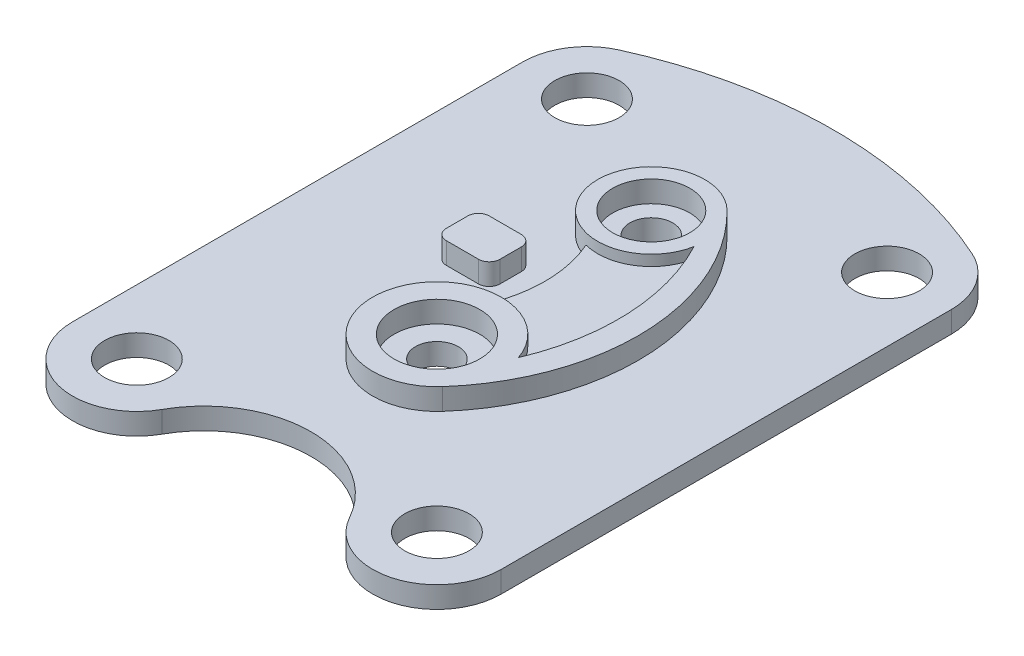
ISO-10303-21;
HEADER;
FILE_DESCRIPTION(('STEP AP214'),'2;1');
FILE_NAME('part.step','',(''),(''),'','','');
FILE_SCHEMA(('AUTOMOTIVE_DESIGN { 1 0 10303 214 1 1 1 1 }'));
ENDSEC;
DATA;
#1=APPLICATION_CONTEXT('core data for automotive mechanical design processes');
#2=APPLICATION_PROTOCOL_DEFINITION('international standard','automotive_design',2000,#1);
#3=PRODUCT_CONTEXT('',#1,'mechanical');
#4=PRODUCT('Part','Part','',(#3));
#5=PRODUCT_RELATED_PRODUCT_CATEGORY('part','',(#4));
#6=PRODUCT_DEFINITION_FORMATION('','',#4);
#7=PRODUCT_DEFINITION_CONTEXT('part definition',#1,'design');
#8=PRODUCT_DEFINITION('design','',#6,#7);
#9=PRODUCT_DEFINITION_SHAPE('','',#8);
#10=(LENGTH_UNIT() NAMED_UNIT(*) SI_UNIT(.MILLI.,.METRE.));
#11=(NAMED_UNIT(*) PLANE_ANGLE_UNIT() SI_UNIT($,.RADIAN.));
#12=(NAMED_UNIT(*) SI_UNIT($,.STERADIAN.) SOLID_ANGLE_UNIT());
#13=UNCERTAINTY_MEASURE_WITH_UNIT(LENGTH_MEASURE(1.E-05),#10,'distance_accuracy_value','');
#14=(GEOMETRIC_REPRESENTATION_CONTEXT(3) GLOBAL_UNCERTAINTY_ASSIGNED_CONTEXT((#13)) GLOBAL_UNIT_ASSIGNED_CONTEXT((#10,
#11,#12)) REPRESENTATION_CONTEXT('',''));
#15=CARTESIAN_POINT('',(0.,0.,0.));
#16=DIRECTION('',(0.,0.,1.));
#17=DIRECTION('',(1.,0.,0.));
#18=AXIS2_PLACEMENT_3D('',#15,#16,#17);
#19=CARTESIAN_POINT('',(0.,10.,0.));
#20=DIRECTION('',(0.,1.,0.));
#21=DIRECTION('',(0.,0.,1.));
#22=AXIS2_PLACEMENT_3D('',#19,#20,#21);
#23=PLANE('',#22);
#24=CARTESIAN_POINT('',(-35.5892365848079,10.,-20.));
#25=DIRECTION('',(0.,1.,0.));
#26=DIRECTION('',(0.,0.,1.));
#27=AXIS2_PLACEMENT_3D('',#24,#25,#26);
#28=CIRCLE('',#27,5.);
#29=CARTESIAN_POINT('',(-35.5892365848078,10.,-25.));
#30=VERTEX_POINT('',#29);
#31=CARTESIAN_POINT('',(-40.5892365848079,10.,-20.));
#32=VERTEX_POINT('',#31);
#33=EDGE_CURVE('E398',#30,#32,#28,.T.);
#34=ORIENTED_EDGE('',*,*,#33,.F.);
#35=DIRECTION('',(-1.,0.,0.));
#36=VECTOR('',#35,1.);
#37=CARTESIAN_POINT('',(0.,10.,-25.));
#38=LINE('',#37,#36);
#39=CARTESIAN_POINT('',(-20.5892365848079,10.,-25.));
#40=VERTEX_POINT('',#39);
#41=EDGE_CURVE('E373',#40,#30,#38,.T.);
#42=ORIENTED_EDGE('',*,*,#41,.F.);
#43=CARTESIAN_POINT('',(-20.5892365848079,10.,-20.));
#44=DIRECTION('',(0.,1.,0.));
#45=DIRECTION('',(0.,0.,1.));
#46=AXIS2_PLACEMENT_3D('',#43,#44,#45);
#47=CIRCLE('',#46,5.);
#48=CARTESIAN_POINT('',(-15.5892365848079,10.,-20.));
#49=VERTEX_POINT('',#48);
#50=EDGE_CURVE('E377',#49,#40,#47,.T.);
#51=ORIENTED_EDGE('',*,*,#50,.F.);
#52=DIRECTION('',(0.,0.,1.));
#53=VECTOR('',#52,1.);
#54=CARTESIAN_POINT('',(-15.5892365848079,10.,0.));
#55=LINE('',#54,#53);
#56=CARTESIAN_POINT('',(-15.5892365848079,10.,-10.));
#57=VERTEX_POINT('',#56);
#58=EDGE_CURVE('E381',#49,#57,#55,.T.);
#59=ORIENTED_EDGE('',*,*,#58,.T.);
#60=CARTESIAN_POINT('',(-20.5892365848079,10.,-10.));
#61=DIRECTION('',(0.,1.,0.));
#62=DIRECTION('',(0.,0.,1.));
#63=AXIS2_PLACEMENT_3D('',#60,#61,#62);
#64=CIRCLE('',#63,5.);
#65=CARTESIAN_POINT('',(-20.5892365848079,10.,-5.00000000000002));
#66=VERTEX_POINT('',#65);
#67=EDGE_CURVE('E384',#57,#66,#64,.F.);
#68=ORIENTED_EDGE('',*,*,#67,.T.);
#69=DIRECTION('',(-1.,0.,0.));
#70=VECTOR('',#69,1.);
#71=CARTESIAN_POINT('',(0.,10.,-5.00000000000002));
#72=LINE('',#71,#70);
#73=CARTESIAN_POINT('',(-35.5892365848078,10.,-5.00000000000002));
#74=VERTEX_POINT('',#73);
#75=EDGE_CURVE('E387',#66,#74,#72,.T.);
#76=ORIENTED_EDGE('',*,*,#75,.T.);
#77=CARTESIAN_POINT('',(-35.5892365848079,10.,-10.));
#78=DIRECTION('',(0.,1.,0.));
#79=DIRECTION('',(0.,0.,1.));
#80=AXIS2_PLACEMENT_3D('',#77,#78,#79);
#81=CIRCLE('',#80,5.);
#82=CARTESIAN_POINT('',(-40.5892365848079,10.,-10.));
#83=VERTEX_POINT('',#82);
#84=EDGE_CURVE('E390',#83,#74,#81,.T.);
#85=ORIENTED_EDGE('',*,*,#84,.F.);
#86=DIRECTION('',(0.,0.,1.));
#87=VECTOR('',#86,1.);
#88=CARTESIAN_POINT('',(-40.5892365848079,10.,0.));
#89=LINE('',#88,#87);
#90=EDGE_CURVE('E394',#32,#83,#89,.T.);
#91=ORIENTED_EDGE('',*,*,#90,.F.);
#92=EDGE_LOOP('',(#34,#42,#51,#59,#68,#76,#85,#91));
#93=FACE_BOUND('',#92,.T.);
#94=CARTESIAN_POINT('',(0.,10.,143.729833462074));
#95=DIRECTION('',(0.,1.,0.));
#96=DIRECTION('',(0.,0.,1.));
#97=AXIS2_PLACEMENT_3D('',#94,#95,#96);
#98=CIRCLE('',#97,50.);
#99=CARTESIAN_POINT('',(43.75,10.,119.523687548278));
#100=VERTEX_POINT('',#99);
#101=CARTESIAN_POINT('',(-43.75,10.,119.523687548278));
#102=VERTEX_POINT('',#101);
#103=EDGE_CURVE('E403',#100,#102,#98,.T.);
#104=ORIENTED_EDGE('',*,*,#103,.F.);
#105=CARTESIAN_POINT('',(70.,10.,105.));
#106=DIRECTION('',(0.,1.,0.));
#107=DIRECTION('',(0.,0.,1.));
#108=AXIS2_PLACEMENT_3D('',#105,#106,#107);
#109=CIRCLE('',#108,30.);
#110=CARTESIAN_POINT('',(100.,10.,105.));
#111=VERTEX_POINT('',#110);
#112=EDGE_CURVE('E407',#100,#111,#109,.T.);
#113=ORIENTED_EDGE('',*,*,#112,.T.);
#114=DIRECTION('',(0.,0.,1.));
#115=VECTOR('',#114,1.);
#116=CARTESIAN_POINT('',(100.,10.,0.));
#117=LINE('',#116,#115);
#118=CARTESIAN_POINT('',(100.,10.,-105.));
#119=VERTEX_POINT('',#118);
#120=EDGE_CURVE('E411',#119,#111,#117,.T.);
#121=ORIENTED_EDGE('',*,*,#120,.F.);
#122=CARTESIAN_POINT('',(70.,10.,-105.));
#123=DIRECTION('',(0.,1.,0.));
#124=DIRECTION('',(0.,0.,1.));
#125=AXIS2_PLACEMENT_3D('',#122,#123,#124);
#126=CIRCLE('',#125,30.);
#127=CARTESIAN_POINT('',(82.3529411764706,10.,-132.338705973229));
#128=VERTEX_POINT('',#127);
#129=EDGE_CURVE('E415',#119,#128,#126,.T.);
#130=ORIENTED_EDGE('',*,*,#129,.T.);
#131=CARTESIAN_POINT('',(-1.03060153208433E-13,10.,49.9193338482967));
#132=DIRECTION('',(0.,1.,0.));
#133=DIRECTION('',(0.,0.,1.));
#134=AXIS2_PLACEMENT_3D('',#131,#132,#133);
#135=CIRCLE('',#134,200.);
#136=CARTESIAN_POINT('',(-82.3529411764706,10.,-132.338705973229));
#137=VERTEX_POINT('',#136);
#138=EDGE_CURVE('E418',#128,#137,#135,.T.);
#139=ORIENTED_EDGE('',*,*,#138,.T.);
#140=CARTESIAN_POINT('',(-70.,10.,-105.));
#141=DIRECTION('',(0.,1.,0.));
#142=DIRECTION('',(0.,0.,1.));
#143=AXIS2_PLACEMENT_3D('',#140,#141,#142);
#144=CIRCLE('',#143,30.);
#145=CARTESIAN_POINT('',(-100.,10.,-105.));
#146=VERTEX_POINT('',#145);
#147=EDGE_CURVE('E421',#137,#146,#144,.T.);
#148=ORIENTED_EDGE('',*,*,#147,.T.);
#149=DIRECTION('',(0.,0.,1.));
#150=VECTOR('',#149,1.);
#151=CARTESIAN_POINT('',(-100.,10.,0.));
#152=LINE('',#151,#150);
#153=CARTESIAN_POINT('',(-100.,10.,105.));
#154=VERTEX_POINT('',#153);
#155=EDGE_CURVE('E424',#146,#154,#152,.T.);
#156=ORIENTED_EDGE('',*,*,#155,.T.);
#157=CARTESIAN_POINT('',(-70.,10.,105.));
#158=DIRECTION('',(0.,1.,0.));
#159=DIRECTION('',(0.,0.,1.));
#160=AXIS2_PLACEMENT_3D('',#157,#158,#159);
#161=CIRCLE('',#160,30.);
#162=EDGE_CURVE('E427',#154,#102,#161,.T.);
#163=ORIENTED_EDGE('',*,*,#162,.T.);
#164=EDGE_LOOP('',(#104,#113,#121,#130,#139,#148,#156,#163));
#165=FACE_BOUND('',#164,.T.);
#166=CARTESIAN_POINT('',(70.,10.,105.));
#167=DIRECTION('',(0.,1.,0.));
#168=DIRECTION('',(0.,0.,1.));
#169=AXIS2_PLACEMENT_3D('',#166,#167,#168);
#170=CIRCLE('',#169,15.);
#171=CARTESIAN_POINT('',(70.,10.,120.));
#172=VERTEX_POINT('',#171);
#173=EDGE_CURVE('E430',#172,#172,#170,.T.);
#174=ORIENTED_EDGE('',*,*,#173,.F.);
#175=EDGE_LOOP('',(#174));
#176=FACE_BOUND('',#175,.T.);
#177=CARTESIAN_POINT('',(-70.,10.,-105.));
#178=DIRECTION('',(0.,1.,0.));
#179=DIRECTION('',(0.,0.,1.));
#180=AXIS2_PLACEMENT_3D('',#177,#178,#179);
#181=CIRCLE('',#180,15.);
#182=CARTESIAN_POINT('',(-70.,10.,-90.));
#183=VERTEX_POINT('',#182);
#184=EDGE_CURVE('E434',#183,#183,#181,.T.);
#185=ORIENTED_EDGE('',*,*,#184,.F.);
#186=EDGE_LOOP('',(#185));
#187=FACE_BOUND('',#186,.T.);
#188=CARTESIAN_POINT('',(70.,10.,-105.));
#189=DIRECTION('',(0.,1.,0.));
#190=DIRECTION('',(0.,0.,1.));
#191=AXIS2_PLACEMENT_3D('',#188,#189,#190);
#192=CIRCLE('',#191,15.);
#193=CARTESIAN_POINT('',(70.,10.,-90.));
#194=VERTEX_POINT('',#193);
#195=EDGE_CURVE('E438',#194,#194,#192,.T.);
#196=ORIENTED_EDGE('',*,*,#195,.F.);
#197=EDGE_LOOP('',(#196));
#198=FACE_BOUND('',#197,.T.);
#199=CARTESIAN_POINT('',(-70.,10.,105.));
#200=DIRECTION('',(0.,1.,0.));
#201=DIRECTION('',(0.,0.,1.));
#202=AXIS2_PLACEMENT_3D('',#199,#200,#201);
#203=CIRCLE('',#202,15.);
#204=CARTESIAN_POINT('',(-70.,10.,120.));
#205=VERTEX_POINT('',#204);
#206=EDGE_CURVE('E442',#205,#205,#203,.T.);
#207=ORIENTED_EDGE('',*,*,#206,.F.);
#208=EDGE_LOOP('',(#207));
#209=FACE_BOUND('',#208,.T.);
#210=CARTESIAN_POINT('',(0.,10.,35.));
#211=DIRECTION('',(0.,1.,0.));
#212=DIRECTION('',(0.,0.,1.));
#213=AXIS2_PLACEMENT_3D('',#210,#211,#212);
#214=CIRCLE('',#213,30.);
#215=CARTESIAN_POINT('',(22.471857399868,10.,54.875));
#216=VERTEX_POINT('',#215);
#217=CARTESIAN_POINT('',(-5.35471427427675,10.,5.48175081342294));
#218=VERTEX_POINT('',#217);
#219=EDGE_CURVE('E305',#216,#218,#214,.F.);
#220=ORIENTED_EDGE('',*,*,#219,.T.);
#221=CARTESIAN_POINT('',(-61.1514807670264,10.,-16.58));
#222=DIRECTION('',(0.,1.,0.));
#223=DIRECTION('',(0.,0.,1.));
#224=AXIS2_PLACEMENT_3D('',#221,#222,#223);
#225=CIRCLE('',#224,60.);
#226=CARTESIAN_POINT('',(-6.25496791206931,10.,-40.7951373393902));
#227=VERTEX_POINT('',#226);
#228=EDGE_CURVE('E258',#218,#227,#225,.T.);
#229=ORIENTED_EDGE('',*,*,#228,.T.);
#230=CARTESIAN_POINT('',(0.,10.,-65.));
#231=DIRECTION('',(0.,1.,0.));
#232=DIRECTION('',(0.,0.,1.));
#233=AXIS2_PLACEMENT_3D('',#230,#231,#232);
#234=CIRCLE('',#233,25.);
#235=CARTESIAN_POINT('',(17.4781113110084,10.,-82.875));
#236=VERTEX_POINT('',#235);
#237=EDGE_CURVE('E256',#227,#236,#234,.F.);
#238=ORIENTED_EDGE('',*,*,#237,.T.);
#239=CARTESIAN_POINT('',(-52.4343339330252,10.,-11.375));
#240=DIRECTION('',(0.,1.,0.));
#241=DIRECTION('',(0.,0.,1.));
#242=AXIS2_PLACEMENT_3D('',#239,#240,#241);
#243=CIRCLE('',#242,100.);
#244=EDGE_CURVE('E299',#236,#216,#243,.F.);
#245=ORIENTED_EDGE('',*,*,#244,.T.);
#246=EDGE_LOOP('',(#220,#229,#238,#245));
#247=FACE_BOUND('',#246,.T.);
#248=ADVANCED_FACE('F81',(#93,#165,#176,#187,#198,#209,#247),#23,.T.);
#249=CARTESIAN_POINT('',(0.,20.,-65.));
#250=DIRECTION('',(0.,-1.,0.));
#251=DIRECTION('',(0.,0.,-1.));
#252=AXIS2_PLACEMENT_3D('',#249,#250,#251);
#253=CYLINDRICAL_SURFACE('',#252,25.);
#254=DIRECTION('',(0.,-1.,0.));
#255=VECTOR('',#254,1.);
#256=CARTESIAN_POINT('',(-6.25496791206931,15.,-40.7951373393902));
#257=LINE('',#256,#255);
#258=CARTESIAN_POINT('',(-6.25496791206931,15.,-40.7951373393902));
#259=VERTEX_POINT('',#258);
#260=EDGE_CURVE('E236',#259,#227,#257,.T.);
#261=ORIENTED_EDGE('',*,*,#260,.F.);
#262=CARTESIAN_POINT('',(0.,15.,-65.));
#263=DIRECTION('',(0.,1.,0.));
#264=DIRECTION('',(0.,0.,1.));
#265=AXIS2_PLACEMENT_3D('',#262,#263,#264);
#266=CIRCLE('',#265,25.);
#267=CARTESIAN_POINT('',(24.5652216743476,15.,-60.3578147290136));
#268=VERTEX_POINT('',#267);
#269=EDGE_CURVE('E242',#259,#268,#266,.T.);
#270=ORIENTED_EDGE('',*,*,#269,.T.);
#271=DIRECTION('',(0.,-1.,0.));
#272=VECTOR('',#271,1.);
#273=CARTESIAN_POINT('',(24.5652216743476,20.,-60.3578147290136));
#274=LINE('',#273,#272);
#275=CARTESIAN_POINT('',(24.5652216743476,20.,-60.3578147290136));
#276=VERTEX_POINT('',#275);
#277=EDGE_CURVE('E296',#276,#268,#274,.T.);
#278=ORIENTED_EDGE('',*,*,#277,.F.);
#279=CARTESIAN_POINT('',(0.,20.,-65.));
#280=DIRECTION('',(0.,1.,0.));
#281=DIRECTION('',(0.,0.,1.));
#282=AXIS2_PLACEMENT_3D('',#279,#280,#281);
#283=CIRCLE('',#282,25.);
#284=CARTESIAN_POINT('',(17.4781113110084,20.,-82.875));
#285=VERTEX_POINT('',#284);
#286=EDGE_CURVE('E262',#285,#276,#283,.T.);
#287=ORIENTED_EDGE('',*,*,#286,.F.);
#288=DIRECTION('',(0.,-1.,0.));
#289=VECTOR('',#288,1.);
#290=CARTESIAN_POINT('',(17.4781113110084,20.,-82.875));
#291=LINE('',#290,#289);
#292=EDGE_CURVE('E287',#285,#236,#291,.T.);
#293=ORIENTED_EDGE('',*,*,#292,.T.);
#294=ORIENTED_EDGE('',*,*,#237,.F.);
#295=EDGE_LOOP('',(#261,#270,#278,#287,#293,#294));
#296=FACE_BOUND('',#295,.T.);
#297=ADVANCED_FACE('F254',(#296),#253,.T.);
#298=CARTESIAN_POINT('',(0.,20.,35.));
#299=DIRECTION('',(0.,-1.,0.));
#300=DIRECTION('',(0.,0.,-1.));
#301=AXIS2_PLACEMENT_3D('',#298,#299,#300);
#302=CYLINDRICAL_SURFACE('',#301,30.);
#303=DIRECTION('',(0.,-1.,0.));
#304=VECTOR('',#303,1.);
#305=CARTESIAN_POINT('',(-5.35471427427675,15.,5.48175081342294));
#306=LINE('',#305,#304);
#307=CARTESIAN_POINT('',(-5.35471427427674,15.,5.48175081342292));
#308=VERTEX_POINT('',#307);
#309=EDGE_CURVE('E99',#308,#218,#306,.T.);
#310=ORIENTED_EDGE('',*,*,#309,.T.);
#311=ORIENTED_EDGE('',*,*,#219,.F.);
#312=DIRECTION('',(0.,-1.,0.));
#313=VECTOR('',#312,1.);
#314=CARTESIAN_POINT('',(22.471857399868,20.,54.875));
#315=LINE('',#314,#313);
#316=CARTESIAN_POINT('',(22.471857399868,20.,54.875));
#317=VERTEX_POINT('',#316);
#318=EDGE_CURVE('E107',#317,#216,#315,.T.);
#319=ORIENTED_EDGE('',*,*,#318,.F.);
#320=CARTESIAN_POINT('',(0.,20.,35.));
#321=DIRECTION('',(0.,1.,0.));
#322=DIRECTION('',(0.,0.,1.));
#323=AXIS2_PLACEMENT_3D('',#320,#321,#322);
#324=CIRCLE('',#323,30.);
#325=CARTESIAN_POINT('',(28.4396790634165,20.,25.4509343509498));
#326=VERTEX_POINT('',#325);
#327=EDGE_CURVE('E273',#326,#317,#324,.T.);
#328=ORIENTED_EDGE('',*,*,#327,.F.);
#329=DIRECTION('',(0.,-1.,0.));
#330=VECTOR('',#329,1.);
#331=CARTESIAN_POINT('',(28.4396790634165,20.,25.4509343509498));
#332=LINE('',#331,#330);
#333=CARTESIAN_POINT('',(28.4396790634165,15.,25.4509343509498));
#334=VERTEX_POINT('',#333);
#335=EDGE_CURVE('E292',#326,#334,#332,.T.);
#336=ORIENTED_EDGE('',*,*,#335,.T.);
#337=CARTESIAN_POINT('',(0.,15.,35.));
#338=DIRECTION('',(0.,1.,0.));
#339=DIRECTION('',(0.,0.,1.));
#340=AXIS2_PLACEMENT_3D('',#337,#338,#339);
#341=CIRCLE('',#340,30.);
#342=EDGE_CURVE('E241',#334,#308,#341,.T.);
#343=ORIENTED_EDGE('',*,*,#342,.T.);
#344=EDGE_LOOP('',(#310,#311,#319,#328,#336,#343));
#345=FACE_BOUND('',#344,.T.);
#346=ADVANCED_FACE('F584',(#345),#302,.T.);
#347=CARTESIAN_POINT('',(0.,10.,35.));
#348=DIRECTION('',(0.,1.,0.));
#349=DIRECTION('',(0.,0.,1.));
#350=AXIS2_PLACEMENT_3D('',#347,#348,#349);
#351=CIRCLE('',#350,10.);
#352=CARTESIAN_POINT('',(0.,10.,45.));
#353=VERTEX_POINT('',#352);
#354=EDGE_CURVE('E450',#353,#353,#351,.T.);
#355=ORIENTED_EDGE('',*,*,#354,.F.);
#356=EDGE_LOOP('',(#355));
#357=FACE_BOUND('',#356,.T.);
#358=CARTESIAN_POINT('',(0.,10.,35.));
#359=DIRECTION('',(0.,1.,0.));
#360=DIRECTION('',(0.,0.,1.));
#361=AXIS2_PLACEMENT_3D('',#358,#359,#360);
#362=CIRCLE('',#361,20.);
#363=CARTESIAN_POINT('',(0.,10.,55.));
#364=VERTEX_POINT('',#363);
#365=EDGE_CURVE('E12',#364,#364,#362,.F.);
#366=ORIENTED_EDGE('',*,*,#365,.F.);
#367=EDGE_LOOP('',(#366));
#368=FACE_BOUND('',#367,.T.);
#369=ADVANCED_FACE('F573',(#357,#368),#23,.T.);
#370=CARTESIAN_POINT('',(0.,10.,-65.));
#371=DIRECTION('',(0.,1.,0.));
#372=DIRECTION('',(0.,0.,1.));
#373=AXIS2_PLACEMENT_3D('',#370,#371,#372);
#374=CIRCLE('',#373,10.);
#375=CARTESIAN_POINT('',(0.,10.,-55.));
#376=VERTEX_POINT('',#375);
#377=EDGE_CURVE('E446',#376,#376,#374,.T.);
#378=ORIENTED_EDGE('',*,*,#377,.F.);
#379=EDGE_LOOP('',(#378));
#380=FACE_BOUND('',#379,.T.);
#381=CARTESIAN_POINT('',(0.,10.,-65.));
#382=DIRECTION('',(0.,1.,0.));
#383=DIRECTION('',(0.,0.,1.));
#384=AXIS2_PLACEMENT_3D('',#381,#382,#383);
#385=CIRCLE('',#384,18.);
#386=CARTESIAN_POINT('',(0.,10.,-47.));
#387=VERTEX_POINT('',#386);
#388=EDGE_CURVE('E91',#387,#387,#385,.F.);
#389=ORIENTED_EDGE('',*,*,#388,.F.);
#390=EDGE_LOOP('',(#389));
#391=FACE_BOUND('',#390,.T.);
#392=ADVANCED_FACE('F574',(#380,#391),#23,.T.);
#393=CARTESIAN_POINT('',(0.,10.,143.729833462074));
#394=DIRECTION('',(0.,-1.,0.));
#395=DIRECTION('',(0.,0.,-1.));
#396=AXIS2_PLACEMENT_3D('',#393,#394,#395);
#397=CYLINDRICAL_SURFACE('',#396,50.);
#398=CARTESIAN_POINT('',(0.,0.,143.729833462074));
#399=DIRECTION('',(0.,1.,0.));
#400=DIRECTION('',(0.,0.,1.));
#401=AXIS2_PLACEMENT_3D('',#398,#399,#400);
#402=CIRCLE('',#401,50.);
#403=CARTESIAN_POINT('',(43.75,0.,119.523687548278));
#404=VERTEX_POINT('',#403);
#405=CARTESIAN_POINT('',(-43.75,0.,119.523687548278));
#406=VERTEX_POINT('',#405);
#407=EDGE_CURVE('E402',#404,#406,#402,.T.);
#408=ORIENTED_EDGE('',*,*,#407,.F.);
#409=DIRECTION('',(0.,-1.,0.));
#410=VECTOR('',#409,1.);
#411=CARTESIAN_POINT('',(43.75,10.,119.523687548278));
#412=LINE('',#411,#410);
#413=EDGE_CURVE('E85',#100,#404,#412,.T.);
#414=ORIENTED_EDGE('',*,*,#413,.F.);
#415=ORIENTED_EDGE('',*,*,#103,.T.);
#416=DIRECTION('',(0.,-1.,0.));
#417=VECTOR('',#416,1.);
#418=CARTESIAN_POINT('',(-43.75,10.,119.523687548278));
#419=LINE('',#418,#417);
#420=EDGE_CURVE('E454',#102,#406,#419,.T.);
#421=ORIENTED_EDGE('',*,*,#420,.T.);
#422=EDGE_LOOP('',(#408,#414,#415,#421));
#423=FACE_BOUND('',#422,.T.);
#424=ADVANCED_FACE('F83',(#423),#397,.F.);
#425=CARTESIAN_POINT('',(70.,10.,105.));
#426=DIRECTION('',(0.,-1.,0.));
#427=DIRECTION('',(0.,0.,-1.));
#428=AXIS2_PLACEMENT_3D('',#425,#426,#427);
#429=CYLINDRICAL_SURFACE('',#428,30.);
#430=CARTESIAN_POINT('',(70.,0.,105.));
#431=DIRECTION('',(0.,1.,0.));
#432=DIRECTION('',(0.,0.,1.));
#433=AXIS2_PLACEMENT_3D('',#430,#431,#432);
#434=CIRCLE('',#433,30.);
#435=CARTESIAN_POINT('',(100.,0.,105.));
#436=VERTEX_POINT('',#435);
#437=EDGE_CURVE('E458',#404,#436,#434,.T.);
#438=ORIENTED_EDGE('',*,*,#437,.T.);
#439=DIRECTION('',(0.,-1.,0.));
#440=VECTOR('',#439,1.);
#441=CARTESIAN_POINT('',(100.,10.,105.));
#442=LINE('',#441,#440);
#443=EDGE_CURVE('E525',#111,#436,#442,.T.);
#444=ORIENTED_EDGE('',*,*,#443,.F.);
#445=ORIENTED_EDGE('',*,*,#112,.F.);
#446=ORIENTED_EDGE('',*,*,#413,.T.);
#447=EDGE_LOOP('',(#438,#444,#445,#446));
#448=FACE_BOUND('',#447,.T.);
#449=ADVANCED_FACE('F534',(#448),#429,.T.);
#450=CARTESIAN_POINT('',(100.,10.,0.));
#451=DIRECTION('',(1.,0.,0.));
#452=DIRECTION('',(0.,0.,-1.));
#453=AXIS2_PLACEMENT_3D('',#450,#451,#452);
#454=PLANE('',#453);
#455=DIRECTION('',(0.,0.,1.));
#456=VECTOR('',#455,1.);
#457=CARTESIAN_POINT('',(100.,0.,0.));
#458=LINE('',#457,#456);
#459=CARTESIAN_POINT('',(100.,0.,-105.));
#460=VERTEX_POINT('',#459);
#461=EDGE_CURVE('E462',#460,#436,#458,.T.);
#462=ORIENTED_EDGE('',*,*,#461,.F.);
#463=DIRECTION('',(0.,-1.,0.));
#464=VECTOR('',#463,1.);
#465=CARTESIAN_POINT('',(100.,10.,-105.));
#466=LINE('',#465,#464);
#467=EDGE_CURVE('E523',#119,#460,#466,.T.);
#468=ORIENTED_EDGE('',*,*,#467,.F.);
#469=ORIENTED_EDGE('',*,*,#120,.T.);
#470=ORIENTED_EDGE('',*,*,#443,.T.);
#471=EDGE_LOOP('',(#462,#468,#469,#470));
#472=FACE_BOUND('',#471,.T.);
#473=ADVANCED_FACE('F564',(#472),#454,.T.);
#474=CARTESIAN_POINT('',(70.,10.,-105.));
#475=DIRECTION('',(0.,-1.,0.));
#476=DIRECTION('',(0.,0.,-1.));
#477=AXIS2_PLACEMENT_3D('',#474,#475,#476);
#478=CYLINDRICAL_SURFACE('',#477,30.);
#479=CARTESIAN_POINT('',(70.,0.,-105.));
#480=DIRECTION('',(0.,1.,0.));
#481=DIRECTION('',(0.,0.,1.));
#482=AXIS2_PLACEMENT_3D('',#479,#480,#481);
#483=CIRCLE('',#482,30.);
#484=CARTESIAN_POINT('',(82.3529411764706,0.,-132.338705973229));
#485=VERTEX_POINT('',#484);
#486=EDGE_CURVE('E466',#460,#485,#483,.T.);
#487=ORIENTED_EDGE('',*,*,#486,.T.);
#488=DIRECTION('',(0.,-1.,0.));
#489=VECTOR('',#488,1.);
#490=CARTESIAN_POINT('',(82.3529411764706,10.,-132.338705973229));
#491=LINE('',#490,#489);
#492=EDGE_CURVE('E519',#128,#485,#491,.T.);
#493=ORIENTED_EDGE('',*,*,#492,.F.);
#494=ORIENTED_EDGE('',*,*,#129,.F.);
#495=ORIENTED_EDGE('',*,*,#467,.T.);
#496=EDGE_LOOP('',(#487,#493,#494,#495));
#497=FACE_BOUND('',#496,.T.);
#498=ADVANCED_FACE('F567',(#497),#478,.T.);
#499=CARTESIAN_POINT('',(-1.03060153208433E-13,10.,49.9193338482967));
#500=DIRECTION('',(0.,-1.,0.));
#501=DIRECTION('',(0.,0.,-1.));
#502=AXIS2_PLACEMENT_3D('',#499,#500,#501);
#503=CYLINDRICAL_SURFACE('',#502,200.);
#504=CARTESIAN_POINT('',(-1.03060153208433E-13,0.,49.9193338482967));
#505=DIRECTION('',(0.,1.,0.));
#506=DIRECTION('',(0.,0.,1.));
#507=AXIS2_PLACEMENT_3D('',#504,#505,#506);
#508=CIRCLE('',#507,200.);
#509=CARTESIAN_POINT('',(-82.3529411764706,0.,-132.338705973229));
#510=VERTEX_POINT('',#509);
#511=EDGE_CURVE('E469',#485,#510,#508,.T.);
#512=ORIENTED_EDGE('',*,*,#511,.T.);
#513=DIRECTION('',(0.,-1.,0.));
#514=VECTOR('',#513,1.);
#515=CARTESIAN_POINT('',(-82.3529411764706,10.,-132.338705973229));
#516=LINE('',#515,#514);
#517=EDGE_CURVE('E515',#137,#510,#516,.T.);
#518=ORIENTED_EDGE('',*,*,#517,.F.);
#519=ORIENTED_EDGE('',*,*,#138,.F.);
#520=ORIENTED_EDGE('',*,*,#492,.T.);
#521=EDGE_LOOP('',(#512,#518,#519,#520));
#522=FACE_BOUND('',#521,.T.);
#523=ADVANCED_FACE('F561',(#522),#503,.T.);
#524=CARTESIAN_POINT('',(-70.,10.,-105.));
#525=DIRECTION('',(0.,-1.,0.));
#526=DIRECTION('',(0.,0.,-1.));
#527=AXIS2_PLACEMENT_3D('',#524,#525,#526);
#528=CYLINDRICAL_SURFACE('',#527,30.);
#529=CARTESIAN_POINT('',(-70.,0.,-105.));
#530=DIRECTION('',(0.,1.,0.));
#531=DIRECTION('',(0.,0.,1.));
#532=AXIS2_PLACEMENT_3D('',#529,#530,#531);
#533=CIRCLE('',#532,30.);
#534=CARTESIAN_POINT('',(-100.,0.,-105.));
#535=VERTEX_POINT('',#534);
#536=EDGE_CURVE('E472',#510,#535,#533,.T.);
#537=ORIENTED_EDGE('',*,*,#536,.T.);
#538=DIRECTION('',(0.,-1.,0.));
#539=VECTOR('',#538,1.);
#540=CARTESIAN_POINT('',(-100.,10.,-105.));
#541=LINE('',#540,#539);
#542=EDGE_CURVE('E511',#146,#535,#541,.T.);
#543=ORIENTED_EDGE('',*,*,#542,.F.);
#544=ORIENTED_EDGE('',*,*,#147,.F.);
#545=ORIENTED_EDGE('',*,*,#517,.T.);
#546=EDGE_LOOP('',(#537,#543,#544,#545));
#547=FACE_BOUND('',#546,.T.);
#548=ADVANCED_FACE('F557',(#547),#528,.T.);
#549=CARTESIAN_POINT('',(-100.,10.,0.));
#550=DIRECTION('',(1.,0.,0.));
#551=DIRECTION('',(0.,0.,-1.));
#552=AXIS2_PLACEMENT_3D('',#549,#550,#551);
#553=PLANE('',#552);
#554=DIRECTION('',(0.,0.,1.));
#555=VECTOR('',#554,1.);
#556=CARTESIAN_POINT('',(-100.,0.,0.));
#557=LINE('',#556,#555);
#558=CARTESIAN_POINT('',(-100.,0.,105.));
#559=VERTEX_POINT('',#558);
#560=EDGE_CURVE('E475',#535,#559,#557,.T.);
#561=ORIENTED_EDGE('',*,*,#560,.T.);
#562=DIRECTION('',(0.,-1.,0.));
#563=VECTOR('',#562,1.);
#564=CARTESIAN_POINT('',(-100.,10.,105.));
#565=LINE('',#564,#563);
#566=EDGE_CURVE('E507',#154,#559,#565,.T.);
#567=ORIENTED_EDGE('',*,*,#566,.F.);
#568=ORIENTED_EDGE('',*,*,#155,.F.);
#569=ORIENTED_EDGE('',*,*,#542,.T.);
#570=EDGE_LOOP('',(#561,#567,#568,#569));
#571=FACE_BOUND('',#570,.T.);
#572=ADVANCED_FACE('F552',(#571),#553,.F.);
#573=CARTESIAN_POINT('',(0.,10.,-65.));
#574=DIRECTION('',(0.,-1.,0.));
#575=DIRECTION('',(0.,0.,-1.));
#576=AXIS2_PLACEMENT_3D('',#573,#574,#575);
#577=CYLINDRICAL_SURFACE('',#576,10.);
#578=ORIENTED_EDGE('',*,*,#377,.T.);
#579=EDGE_LOOP('',(#578));
#580=FACE_BOUND('',#579,.T.);
#581=CARTESIAN_POINT('',(0.,0.,-65.));
#582=DIRECTION('',(0.,1.,0.));
#583=DIRECTION('',(0.,0.,1.));
#584=AXIS2_PLACEMENT_3D('',#581,#582,#583);
#585=CIRCLE('',#584,10.);
#586=CARTESIAN_POINT('',(0.,0.,-55.));
#587=VERTEX_POINT('',#586);
#588=EDGE_CURVE('E498',#587,#587,#585,.T.);
#589=ORIENTED_EDGE('',*,*,#588,.F.);
#590=EDGE_LOOP('',(#589));
#591=FACE_BOUND('',#590,.T.);
#592=ADVANCED_FACE('F659',(#580,#591),#577,.F.);
#593=CARTESIAN_POINT('',(-70.,10.,105.));
#594=DIRECTION('',(0.,-1.,0.));
#595=DIRECTION('',(0.,0.,-1.));
#596=AXIS2_PLACEMENT_3D('',#593,#594,#595);
#597=CYLINDRICAL_SURFACE('',#596,15.);
#598=ORIENTED_EDGE('',*,*,#206,.T.);
#599=EDGE_LOOP('',(#598));
#600=FACE_BOUND('',#599,.T.);
#601=CARTESIAN_POINT('',(-70.,0.,105.));
#602=DIRECTION('',(0.,1.,0.));
#603=DIRECTION('',(0.,0.,1.));
#604=AXIS2_PLACEMENT_3D('',#601,#602,#603);
#605=CIRCLE('',#604,15.);
#606=CARTESIAN_POINT('',(-70.,0.,120.));
#607=VERTEX_POINT('',#606);
#608=EDGE_CURVE('E494',#607,#607,#605,.T.);
#609=ORIENTED_EDGE('',*,*,#608,.F.);
#610=EDGE_LOOP('',(#609));
#611=FACE_BOUND('',#610,.T.);
#612=ADVANCED_FACE('F662',(#600,#611),#597,.F.);
#613=CARTESIAN_POINT('',(70.,10.,-105.));
#614=DIRECTION('',(0.,-1.,0.));
#615=DIRECTION('',(0.,0.,-1.));
#616=AXIS2_PLACEMENT_3D('',#613,#614,#615);
#617=CYLINDRICAL_SURFACE('',#616,15.);
#618=ORIENTED_EDGE('',*,*,#195,.T.);
#619=EDGE_LOOP('',(#618));
#620=FACE_BOUND('',#619,.T.);
#621=CARTESIAN_POINT('',(70.,0.,-105.));
#622=DIRECTION('',(0.,1.,0.));
#623=DIRECTION('',(0.,0.,1.));
#624=AXIS2_PLACEMENT_3D('',#621,#622,#623);
#625=CIRCLE('',#624,15.);
#626=CARTESIAN_POINT('',(70.,0.,-90.));
#627=VERTEX_POINT('',#626);
#628=EDGE_CURVE('E490',#627,#627,#625,.T.);
#629=ORIENTED_EDGE('',*,*,#628,.F.);
#630=EDGE_LOOP('',(#629));
#631=FACE_BOUND('',#630,.T.);
#632=ADVANCED_FACE('F666',(#620,#631),#617,.F.);
#633=CARTESIAN_POINT('',(-70.,10.,-105.));
#634=DIRECTION('',(0.,-1.,0.));
#635=DIRECTION('',(0.,0.,-1.));
#636=AXIS2_PLACEMENT_3D('',#633,#634,#635);
#637=CYLINDRICAL_SURFACE('',#636,15.);
#638=ORIENTED_EDGE('',*,*,#184,.T.);
#639=EDGE_LOOP('',(#638));
#640=FACE_BOUND('',#639,.T.);
#641=CARTESIAN_POINT('',(-70.,0.,-105.));
#642=DIRECTION('',(0.,1.,0.));
#643=DIRECTION('',(0.,0.,1.));
#644=AXIS2_PLACEMENT_3D('',#641,#642,#643);
#645=CIRCLE('',#644,15.);
#646=CARTESIAN_POINT('',(-70.,0.,-90.));
#647=VERTEX_POINT('',#646);
#648=EDGE_CURVE('E486',#647,#647,#645,.T.);
#649=ORIENTED_EDGE('',*,*,#648,.F.);
#650=EDGE_LOOP('',(#649));
#651=FACE_BOUND('',#650,.T.);
#652=ADVANCED_FACE('F670',(#640,#651),#637,.F.);
#653=CARTESIAN_POINT('',(70.,10.,105.));
#654=DIRECTION('',(0.,-1.,0.));
#655=DIRECTION('',(0.,0.,-1.));
#656=AXIS2_PLACEMENT_3D('',#653,#654,#655);
#657=CYLINDRICAL_SURFACE('',#656,15.);
#658=ORIENTED_EDGE('',*,*,#173,.T.);
#659=EDGE_LOOP('',(#658));
#660=FACE_BOUND('',#659,.T.);
#661=CARTESIAN_POINT('',(70.,0.,105.));
#662=DIRECTION('',(0.,1.,0.));
#663=DIRECTION('',(0.,0.,1.));
#664=AXIS2_PLACEMENT_3D('',#661,#662,#663);
#665=CIRCLE('',#664,15.);
#666=CARTESIAN_POINT('',(70.,0.,120.));
#667=VERTEX_POINT('',#666);
#668=EDGE_CURVE('E482',#667,#667,#665,.T.);
#669=ORIENTED_EDGE('',*,*,#668,.F.);
#670=EDGE_LOOP('',(#669));
#671=FACE_BOUND('',#670,.T.);
#672=ADVANCED_FACE('F674',(#660,#671),#657,.F.);
#673=CARTESIAN_POINT('',(-70.,10.,105.));
#674=DIRECTION('',(0.,-1.,0.));
#675=DIRECTION('',(0.,0.,-1.));
#676=AXIS2_PLACEMENT_3D('',#673,#674,#675);
#677=CYLINDRICAL_SURFACE('',#676,30.);
#678=CARTESIAN_POINT('',(-70.,0.,105.));
#679=DIRECTION('',(0.,1.,0.));
#680=DIRECTION('',(0.,0.,1.));
#681=AXIS2_PLACEMENT_3D('',#678,#679,#680);
#682=CIRCLE('',#681,30.);
#683=EDGE_CURVE('E478',#559,#406,#682,.T.);
#684=ORIENTED_EDGE('',*,*,#683,.T.);
#685=ORIENTED_EDGE('',*,*,#420,.F.);
#686=ORIENTED_EDGE('',*,*,#162,.F.);
#687=ORIENTED_EDGE('',*,*,#566,.T.);
#688=EDGE_LOOP('',(#684,#685,#686,#687));
#689=FACE_BOUND('',#688,.T.);
#690=ADVANCED_FACE('F546',(#689),#677,.T.);
#691=CARTESIAN_POINT('',(0.,10.,35.));
#692=DIRECTION('',(0.,-1.,0.));
#693=DIRECTION('',(0.,0.,-1.));
#694=AXIS2_PLACEMENT_3D('',#691,#692,#693);
#695=CYLINDRICAL_SURFACE('',#694,10.);
#696=ORIENTED_EDGE('',*,*,#354,.T.);
#697=EDGE_LOOP('',(#696));
#698=FACE_BOUND('',#697,.T.);
#699=CARTESIAN_POINT('',(0.,0.,35.));
#700=DIRECTION('',(0.,1.,0.));
#701=DIRECTION('',(0.,0.,1.));
#702=AXIS2_PLACEMENT_3D('',#699,#700,#701);
#703=CIRCLE('',#702,10.);
#704=CARTESIAN_POINT('',(0.,0.,45.));
#705=VERTEX_POINT('',#704);
#706=EDGE_CURVE('E408',#705,#705,#703,.T.);
#707=ORIENTED_EDGE('',*,*,#706,.F.);
#708=EDGE_LOOP('',(#707));
#709=FACE_BOUND('',#708,.T.);
#710=ADVANCED_FACE('F655',(#698,#709),#695,.F.);
#711=CARTESIAN_POINT('',(0.,0.,0.));
#712=DIRECTION('',(0.,1.,0.));
#713=DIRECTION('',(0.,0.,1.));
#714=AXIS2_PLACEMENT_3D('',#711,#712,#713);
#715=PLANE('',#714);
#716=ORIENTED_EDGE('',*,*,#407,.T.);
#717=ORIENTED_EDGE('',*,*,#683,.F.);
#718=ORIENTED_EDGE('',*,*,#560,.F.);
#719=ORIENTED_EDGE('',*,*,#536,.F.);
#720=ORIENTED_EDGE('',*,*,#511,.F.);
#721=ORIENTED_EDGE('',*,*,#486,.F.);
#722=ORIENTED_EDGE('',*,*,#461,.T.);
#723=ORIENTED_EDGE('',*,*,#437,.F.);
#724=EDGE_LOOP('',(#716,#717,#718,#719,#720,#721,#722,#723));
#725=FACE_BOUND('',#724,.T.);
#726=ORIENTED_EDGE('',*,*,#668,.T.);
#727=EDGE_LOOP('',(#726));
#728=FACE_BOUND('',#727,.T.);
#729=ORIENTED_EDGE('',*,*,#648,.T.);
#730=EDGE_LOOP('',(#729));
#731=FACE_BOUND('',#730,.T.);
#732=ORIENTED_EDGE('',*,*,#628,.T.);
#733=EDGE_LOOP('',(#732));
#734=FACE_BOUND('',#733,.T.);
#735=ORIENTED_EDGE('',*,*,#608,.T.);
#736=EDGE_LOOP('',(#735));
#737=FACE_BOUND('',#736,.T.);
#738=ORIENTED_EDGE('',*,*,#588,.T.);
#739=EDGE_LOOP('',(#738));
#740=FACE_BOUND('',#739,.T.);
#741=ORIENTED_EDGE('',*,*,#706,.T.);
#742=EDGE_LOOP('',(#741));
#743=FACE_BOUND('',#742,.T.);
#744=ADVANCED_FACE('F539',(#725,#728,#731,#734,#737,#740,#743),#715,.F.);
#745=CARTESIAN_POINT('',(-35.5892365848079,20.,-20.));
#746=DIRECTION('',(0.,-1.,0.));
#747=DIRECTION('',(0.,0.,-1.));
#748=AXIS2_PLACEMENT_3D('',#745,#746,#747);
#749=CYLINDRICAL_SURFACE('',#748,5.);
#750=DIRECTION('',(0.,-1.,0.));
#751=VECTOR('',#750,1.);
#752=CARTESIAN_POINT('',(-35.5892365848078,20.,-25.));
#753=LINE('',#752,#751);
#754=CARTESIAN_POINT('',(-35.5892365848078,20.,-25.));
#755=VERTEX_POINT('',#754);
#756=EDGE_CURVE('E341',#755,#30,#753,.T.);
#757=ORIENTED_EDGE('',*,*,#756,.T.);
#758=ORIENTED_EDGE('',*,*,#33,.T.);
#759=DIRECTION('',(0.,-1.,0.));
#760=VECTOR('',#759,1.);
#761=CARTESIAN_POINT('',(-40.5892365848079,20.,-20.));
#762=LINE('',#761,#760);
#763=CARTESIAN_POINT('',(-40.5892365848079,20.,-20.));
#764=VERTEX_POINT('',#763);
#765=EDGE_CURVE('E369',#764,#32,#762,.T.);
#766=ORIENTED_EDGE('',*,*,#765,.F.);
#767=CARTESIAN_POINT('',(-35.5892365848079,20.,-20.));
#768=DIRECTION('',(0.,1.,0.));
#769=DIRECTION('',(0.,0.,1.));
#770=AXIS2_PLACEMENT_3D('',#767,#768,#769);
#771=CIRCLE('',#770,5.);
#772=EDGE_CURVE('E312',#764,#755,#771,.F.);
#773=ORIENTED_EDGE('',*,*,#772,.T.);
#774=EDGE_LOOP('',(#757,#758,#766,#773));
#775=FACE_BOUND('',#774,.T.);
#776=ADVANCED_FACE('F648',(#775),#749,.T.);
#777=CARTESIAN_POINT('',(-40.5892365848079,20.,0.));
#778=DIRECTION('',(-1.,0.,0.));
#779=DIRECTION('',(0.,0.,1.));
#780=AXIS2_PLACEMENT_3D('',#777,#778,#779);
#781=PLANE('',#780);
#782=ORIENTED_EDGE('',*,*,#765,.T.);
#783=ORIENTED_EDGE('',*,*,#90,.T.);
#784=DIRECTION('',(0.,-1.,0.));
#785=VECTOR('',#784,1.);
#786=CARTESIAN_POINT('',(-40.5892365848079,20.,-10.));
#787=LINE('',#786,#785);
#788=CARTESIAN_POINT('',(-40.5892365848079,20.,-10.));
#789=VERTEX_POINT('',#788);
#790=EDGE_CURVE('E365',#789,#83,#787,.T.);
#791=ORIENTED_EDGE('',*,*,#790,.F.);
#792=DIRECTION('',(0.,0.,-1.));
#793=VECTOR('',#792,1.);
#794=CARTESIAN_POINT('',(-40.5892365848079,20.,0.));
#795=LINE('',#794,#793);
#796=EDGE_CURVE('E316',#789,#764,#795,.T.);
#797=ORIENTED_EDGE('',*,*,#796,.T.);
#798=EDGE_LOOP('',(#782,#783,#791,#797));
#799=FACE_BOUND('',#798,.T.);
#800=ADVANCED_FACE('F644',(#799),#781,.T.);
#801=CARTESIAN_POINT('',(-35.5892365848079,20.,-10.));
#802=DIRECTION('',(0.,-1.,0.));
#803=DIRECTION('',(0.,0.,-1.));
#804=AXIS2_PLACEMENT_3D('',#801,#802,#803);
#805=CYLINDRICAL_SURFACE('',#804,5.);
#806=ORIENTED_EDGE('',*,*,#790,.T.);
#807=ORIENTED_EDGE('',*,*,#84,.T.);
#808=DIRECTION('',(0.,-1.,0.));
#809=VECTOR('',#808,1.);
#810=CARTESIAN_POINT('',(-35.5892365848078,20.,-5.00000000000002));
#811=LINE('',#810,#809);
#812=CARTESIAN_POINT('',(-35.5892365848078,20.,-5.00000000000002));
#813=VERTEX_POINT('',#812);
#814=EDGE_CURVE('E361',#813,#74,#811,.T.);
#815=ORIENTED_EDGE('',*,*,#814,.F.);
#816=CARTESIAN_POINT('',(-35.5892365848079,20.,-10.));
#817=DIRECTION('',(0.,1.,0.));
#818=DIRECTION('',(0.,0.,1.));
#819=AXIS2_PLACEMENT_3D('',#816,#817,#818);
#820=CIRCLE('',#819,5.);
#821=EDGE_CURVE('E320',#813,#789,#820,.F.);
#822=ORIENTED_EDGE('',*,*,#821,.T.);
#823=EDGE_LOOP('',(#806,#807,#815,#822));
#824=FACE_BOUND('',#823,.T.);
#825=ADVANCED_FACE('F640',(#824),#805,.T.);
#826=CARTESIAN_POINT('',(0.,20.,-5.00000000000002));
#827=DIRECTION('',(0.,0.,-1.));
#828=DIRECTION('',(-1.,0.,0.));
#829=AXIS2_PLACEMENT_3D('',#826,#827,#828);
#830=PLANE('',#829);
#831=ORIENTED_EDGE('',*,*,#75,.F.);
#832=DIRECTION('',(0.,-1.,0.));
#833=VECTOR('',#832,1.);
#834=CARTESIAN_POINT('',(-20.5892365848079,20.,-5.00000000000002));
#835=LINE('',#834,#833);
#836=CARTESIAN_POINT('',(-20.5892365848079,20.,-5.00000000000002));
#837=VERTEX_POINT('',#836);
#838=EDGE_CURVE('E357',#837,#66,#835,.T.);
#839=ORIENTED_EDGE('',*,*,#838,.F.);
#840=DIRECTION('',(1.,0.,0.));
#841=VECTOR('',#840,1.);
#842=CARTESIAN_POINT('',(0.,20.,-5.00000000000002));
#843=LINE('',#842,#841);
#844=EDGE_CURVE('E324',#813,#837,#843,.T.);
#845=ORIENTED_EDGE('',*,*,#844,.F.);
#846=ORIENTED_EDGE('',*,*,#814,.T.);
#847=EDGE_LOOP('',(#831,#839,#845,#846));
#848=FACE_BOUND('',#847,.T.);
#849=ADVANCED_FACE('F636',(#848),#830,.F.);
#850=CARTESIAN_POINT('',(-20.5892365848079,20.,-10.));
#851=DIRECTION('',(0.,-1.,0.));
#852=DIRECTION('',(0.,0.,-1.));
#853=AXIS2_PLACEMENT_3D('',#850,#851,#852);
#854=CYLINDRICAL_SURFACE('',#853,5.);
#855=ORIENTED_EDGE('',*,*,#67,.F.);
#856=DIRECTION('',(0.,-1.,0.));
#857=VECTOR('',#856,1.);
#858=CARTESIAN_POINT('',(-15.5892365848079,20.,-10.));
#859=LINE('',#858,#857);
#860=CARTESIAN_POINT('',(-15.5892365848079,20.,-10.));
#861=VERTEX_POINT('',#860);
#862=EDGE_CURVE('E353',#861,#57,#859,.T.);
#863=ORIENTED_EDGE('',*,*,#862,.F.);
#864=CARTESIAN_POINT('',(-20.5892365848079,20.,-10.));
#865=DIRECTION('',(0.,1.,0.));
#866=DIRECTION('',(0.,0.,1.));
#867=AXIS2_PLACEMENT_3D('',#864,#865,#866);
#868=CIRCLE('',#867,5.);
#869=EDGE_CURVE('E327',#837,#861,#868,.T.);
#870=ORIENTED_EDGE('',*,*,#869,.F.);
#871=ORIENTED_EDGE('',*,*,#838,.T.);
#872=EDGE_LOOP('',(#855,#863,#870,#871));
#873=FACE_BOUND('',#872,.T.);
#874=ADVANCED_FACE('F632',(#873),#854,.T.);
#875=CARTESIAN_POINT('',(-15.5892365848079,20.,0.));
#876=DIRECTION('',(-1.,0.,0.));
#877=DIRECTION('',(0.,0.,1.));
#878=AXIS2_PLACEMENT_3D('',#875,#876,#877);
#879=PLANE('',#878);
#880=ORIENTED_EDGE('',*,*,#58,.F.);
#881=DIRECTION('',(0.,-1.,0.));
#882=VECTOR('',#881,1.);
#883=CARTESIAN_POINT('',(-15.5892365848079,20.,-20.));
#884=LINE('',#883,#882);
#885=CARTESIAN_POINT('',(-15.5892365848079,20.,-20.));
#886=VERTEX_POINT('',#885);
#887=EDGE_CURVE('E349',#886,#49,#884,.T.);
#888=ORIENTED_EDGE('',*,*,#887,.F.);
#889=DIRECTION('',(0.,0.,-1.));
#890=VECTOR('',#889,1.);
#891=CARTESIAN_POINT('',(-15.5892365848079,20.,0.));
#892=LINE('',#891,#890);
#893=EDGE_CURVE('E330',#861,#886,#892,.T.);
#894=ORIENTED_EDGE('',*,*,#893,.F.);
#895=ORIENTED_EDGE('',*,*,#862,.T.);
#896=EDGE_LOOP('',(#880,#888,#894,#895));
#897=FACE_BOUND('',#896,.T.);
#898=ADVANCED_FACE('F628',(#897),#879,.F.);
#899=CARTESIAN_POINT('',(-20.5892365848079,20.,-20.));
#900=DIRECTION('',(0.,-1.,0.));
#901=DIRECTION('',(0.,0.,-1.));
#902=AXIS2_PLACEMENT_3D('',#899,#900,#901);
#903=CYLINDRICAL_SURFACE('',#902,5.);
#904=ORIENTED_EDGE('',*,*,#887,.T.);
#905=ORIENTED_EDGE('',*,*,#50,.T.);
#906=DIRECTION('',(0.,-1.,0.));
#907=VECTOR('',#906,1.);
#908=CARTESIAN_POINT('',(-20.5892365848079,20.,-25.));
#909=LINE('',#908,#907);
#910=CARTESIAN_POINT('',(-20.5892365848079,20.,-25.));
#911=VERTEX_POINT('',#910);
#912=EDGE_CURVE('E345',#911,#40,#909,.T.);
#913=ORIENTED_EDGE('',*,*,#912,.F.);
#914=CARTESIAN_POINT('',(-20.5892365848079,20.,-20.));
#915=DIRECTION('',(0.,1.,0.));
#916=DIRECTION('',(0.,0.,1.));
#917=AXIS2_PLACEMENT_3D('',#914,#915,#916);
#918=CIRCLE('',#917,5.);
#919=EDGE_CURVE('E333',#911,#886,#918,.F.);
#920=ORIENTED_EDGE('',*,*,#919,.T.);
#921=EDGE_LOOP('',(#904,#905,#913,#920));
#922=FACE_BOUND('',#921,.T.);
#923=ADVANCED_FACE('F624',(#922),#903,.T.);
#924=CARTESIAN_POINT('',(0.,20.,-25.));
#925=DIRECTION('',(0.,0.,-1.));
#926=DIRECTION('',(-1.,0.,0.));
#927=AXIS2_PLACEMENT_3D('',#924,#925,#926);
#928=PLANE('',#927);
#929=ORIENTED_EDGE('',*,*,#912,.T.);
#930=ORIENTED_EDGE('',*,*,#41,.T.);
#931=ORIENTED_EDGE('',*,*,#756,.F.);
#932=DIRECTION('',(1.,0.,0.));
#933=VECTOR('',#932,1.);
#934=CARTESIAN_POINT('',(0.,20.,-25.));
#935=LINE('',#934,#933);
#936=EDGE_CURVE('E337',#755,#911,#935,.T.);
#937=ORIENTED_EDGE('',*,*,#936,.T.);
#938=EDGE_LOOP('',(#929,#930,#931,#937));
#939=FACE_BOUND('',#938,.T.);
#940=ADVANCED_FACE('F620',(#939),#928,.T.);
#941=CARTESIAN_POINT('',(0.,20.,0.));
#942=DIRECTION('',(0.,1.,0.));
#943=DIRECTION('',(0.,0.,1.));
#944=AXIS2_PLACEMENT_3D('',#941,#942,#943);
#945=PLANE('',#944);
#946=ORIENTED_EDGE('',*,*,#772,.F.);
#947=ORIENTED_EDGE('',*,*,#796,.F.);
#948=ORIENTED_EDGE('',*,*,#821,.F.);
#949=ORIENTED_EDGE('',*,*,#844,.T.);
#950=ORIENTED_EDGE('',*,*,#869,.T.);
#951=ORIENTED_EDGE('',*,*,#893,.T.);
#952=ORIENTED_EDGE('',*,*,#919,.F.);
#953=ORIENTED_EDGE('',*,*,#936,.F.);
#954=EDGE_LOOP('',(#946,#947,#948,#949,#950,#951,#952,#953));
#955=FACE_BOUND('',#954,.T.);
#956=ADVANCED_FACE('F615',(#955),#945,.T.);
#957=CARTESIAN_POINT('',(-63.7132293954717,20.,-13.38));
#958=DIRECTION('',(0.,-1.,0.));
#959=DIRECTION('',(0.,0.,-1.));
#960=AXIS2_PLACEMENT_3D('',#957,#958,#959);
#961=CYLINDRICAL_SURFACE('',#960,100.);
#962=ORIENTED_EDGE('',*,*,#277,.T.);
#963=CARTESIAN_POINT('',(-63.7132293954717,15.,-13.38));
#964=DIRECTION('',(0.,1.,0.));
#965=DIRECTION('',(0.,0.,1.));
#966=AXIS2_PLACEMENT_3D('',#963,#964,#965);
#967=CIRCLE('',#966,100.);
#968=EDGE_CURVE('E247',#268,#334,#967,.F.);
#969=ORIENTED_EDGE('',*,*,#968,.T.);
#970=ORIENTED_EDGE('',*,*,#335,.F.);
#971=CARTESIAN_POINT('',(-63.7132293954717,20.,-13.38));
#972=DIRECTION('',(0.,1.,0.));
#973=DIRECTION('',(0.,0.,1.));
#974=AXIS2_PLACEMENT_3D('',#971,#972,#973);
#975=CIRCLE('',#974,100.);
#976=EDGE_CURVE('E270',#276,#326,#975,.F.);
#977=ORIENTED_EDGE('',*,*,#976,.F.);
#978=EDGE_LOOP('',(#962,#969,#970,#977));
#979=FACE_BOUND('',#978,.T.);
#980=ADVANCED_FACE('F591',(#979),#961,.F.);
#981=CARTESIAN_POINT('',(0.,20.,35.));
#982=DIRECTION('',(0.,-1.,0.));
#983=DIRECTION('',(0.,0.,-1.));
#984=AXIS2_PLACEMENT_3D('',#981,#982,#983);
#985=CYLINDRICAL_SURFACE('',#984,20.);
#986=ORIENTED_EDGE('',*,*,#365,.T.);
#987=EDGE_LOOP('',(#986));
#988=FACE_BOUND('',#987,.T.);
#989=CARTESIAN_POINT('',(0.,20.,35.));
#990=DIRECTION('',(0.,1.,0.));
#991=DIRECTION('',(0.,0.,1.));
#992=AXIS2_PLACEMENT_3D('',#989,#990,#991);
#993=CIRCLE('',#992,20.);
#994=CARTESIAN_POINT('',(0.,20.,55.));
#995=VERTEX_POINT('',#994);
#996=EDGE_CURVE('E279',#995,#995,#993,.T.);
#997=ORIENTED_EDGE('',*,*,#996,.T.);
#998=EDGE_LOOP('',(#997));
#999=FACE_BOUND('',#998,.T.);
#1000=ADVANCED_FACE('F600',(#988,#999),#985,.F.);
#1001=CARTESIAN_POINT('',(-52.4343339330252,20.,-11.375));
#1002=DIRECTION('',(0.,-1.,0.));
#1003=DIRECTION('',(0.,0.,-1.));
#1004=AXIS2_PLACEMENT_3D('',#1001,#1002,#1003);
#1005=CYLINDRICAL_SURFACE('',#1004,100.);
#1006=ORIENTED_EDGE('',*,*,#244,.F.);
#1007=ORIENTED_EDGE('',*,*,#292,.F.);
#1008=CARTESIAN_POINT('',(-52.4343339330252,20.,-11.375));
#1009=DIRECTION('',(0.,1.,0.));
#1010=DIRECTION('',(0.,0.,1.));
#1011=AXIS2_PLACEMENT_3D('',#1008,#1009,#1010);
#1012=CIRCLE('',#1011,100.);
#1013=EDGE_CURVE('E276',#317,#285,#1012,.T.);
#1014=ORIENTED_EDGE('',*,*,#1013,.F.);
#1015=ORIENTED_EDGE('',*,*,#318,.T.);
#1016=EDGE_LOOP('',(#1006,#1007,#1014,#1015));
#1017=FACE_BOUND('',#1016,.T.);
#1018=ADVANCED_FACE('F597',(#1017),#1005,.T.);
#1019=CARTESIAN_POINT('',(0.,20.,-65.));
#1020=DIRECTION('',(0.,-1.,0.));
#1021=DIRECTION('',(0.,0.,-1.));
#1022=AXIS2_PLACEMENT_3D('',#1019,#1020,#1021);
#1023=CYLINDRICAL_SURFACE('',#1022,18.);
#1024=ORIENTED_EDGE('',*,*,#388,.T.);
#1025=EDGE_LOOP('',(#1024));
#1026=FACE_BOUND('',#1025,.T.);
#1027=CARTESIAN_POINT('',(0.,20.,-65.));
#1028=DIRECTION('',(0.,1.,0.));
#1029=DIRECTION('',(0.,0.,1.));
#1030=AXIS2_PLACEMENT_3D('',#1027,#1028,#1029);
#1031=CIRCLE('',#1030,18.);
#1032=CARTESIAN_POINT('',(0.,20.,-47.));
#1033=VERTEX_POINT('',#1032);
#1034=EDGE_CURVE('E283',#1033,#1033,#1031,.T.);
#1035=ORIENTED_EDGE('',*,*,#1034,.T.);
#1036=EDGE_LOOP('',(#1035));
#1037=FACE_BOUND('',#1036,.T.);
#1038=ADVANCED_FACE('F599',(#1026,#1037),#1023,.F.);
#1039=CARTESIAN_POINT('',(0.,20.,0.));
#1040=DIRECTION('',(0.,1.,0.));
#1041=DIRECTION('',(0.,0.,1.));
#1042=AXIS2_PLACEMENT_3D('',#1039,#1040,#1041);
#1043=PLANE('',#1042);
#1044=ORIENTED_EDGE('',*,*,#286,.T.);
#1045=ORIENTED_EDGE('',*,*,#976,.T.);
#1046=ORIENTED_EDGE('',*,*,#327,.T.);
#1047=ORIENTED_EDGE('',*,*,#1013,.T.);
#1048=EDGE_LOOP('',(#1044,#1045,#1046,#1047));
#1049=FACE_BOUND('',#1048,.T.);
#1050=ORIENTED_EDGE('',*,*,#996,.F.);
#1051=EDGE_LOOP('',(#1050));
#1052=FACE_BOUND('',#1051,.T.);
#1053=ORIENTED_EDGE('',*,*,#1034,.F.);
#1054=EDGE_LOOP('',(#1053));
#1055=FACE_BOUND('',#1054,.T.);
#1056=ADVANCED_FACE('F595',(#1049,#1052,#1055),#1043,.T.);
#1057=CARTESIAN_POINT('',(-61.1514807670264,15.,-16.58));
#1058=DIRECTION('',(0.,-1.,0.));
#1059=DIRECTION('',(0.,0.,-1.));
#1060=AXIS2_PLACEMENT_3D('',#1057,#1058,#1059);
#1061=CYLINDRICAL_SURFACE('',#1060,60.);
#1062=ORIENTED_EDGE('',*,*,#228,.F.);
#1063=ORIENTED_EDGE('',*,*,#309,.F.);
#1064=CARTESIAN_POINT('',(-61.1514807670264,15.,-16.58));
#1065=DIRECTION('',(0.,1.,0.));
#1066=DIRECTION('',(0.,0.,1.));
#1067=AXIS2_PLACEMENT_3D('',#1064,#1065,#1066);
#1068=CIRCLE('',#1067,60.);
#1069=EDGE_CURVE('E232',#259,#308,#1068,.F.);
#1070=ORIENTED_EDGE('',*,*,#1069,.F.);
#1071=ORIENTED_EDGE('',*,*,#260,.T.);
#1072=EDGE_LOOP('',(#1062,#1063,#1070,#1071));
#1073=FACE_BOUND('',#1072,.T.);
#1074=ADVANCED_FACE('F234',(#1073),#1061,.F.);
#1075=CARTESIAN_POINT('',(0.,15.,0.));
#1076=DIRECTION('',(0.,1.,0.));
#1077=DIRECTION('',(0.,0.,1.));
#1078=AXIS2_PLACEMENT_3D('',#1075,#1076,#1077);
#1079=PLANE('',#1078);
#1080=ORIENTED_EDGE('',*,*,#269,.F.);
#1081=ORIENTED_EDGE('',*,*,#1069,.T.);
#1082=ORIENTED_EDGE('',*,*,#342,.F.);
#1083=ORIENTED_EDGE('',*,*,#968,.F.);
#1084=EDGE_LOOP('',(#1080,#1081,#1082,#1083));
#1085=FACE_BOUND('',#1084,.T.);
#1086=ADVANCED_FACE('F245',(#1085),#1079,.T.);
#1087=CLOSED_SHELL('',(#248,#297,#346,#369,#392,#424,#449,#473,#498,#523,#548,#572,#592,#612,
#632,#652,#672,#690,#710,#744,#776,#800,#825,#849,#874,#898,#923,#940,#956,#980,#1000,#1018,
#1038,#1056,#1074,#1086));
#1088=MANIFOLD_SOLID_BREP('B2',#1087);
#1089=ADVANCED_BREP_SHAPE_REPRESENTATION('',(#18,#1088),#14);
#1090=SHAPE_DEFINITION_REPRESENTATION(#9,#1089);
ENDSEC;
END-ISO-10303-21;
